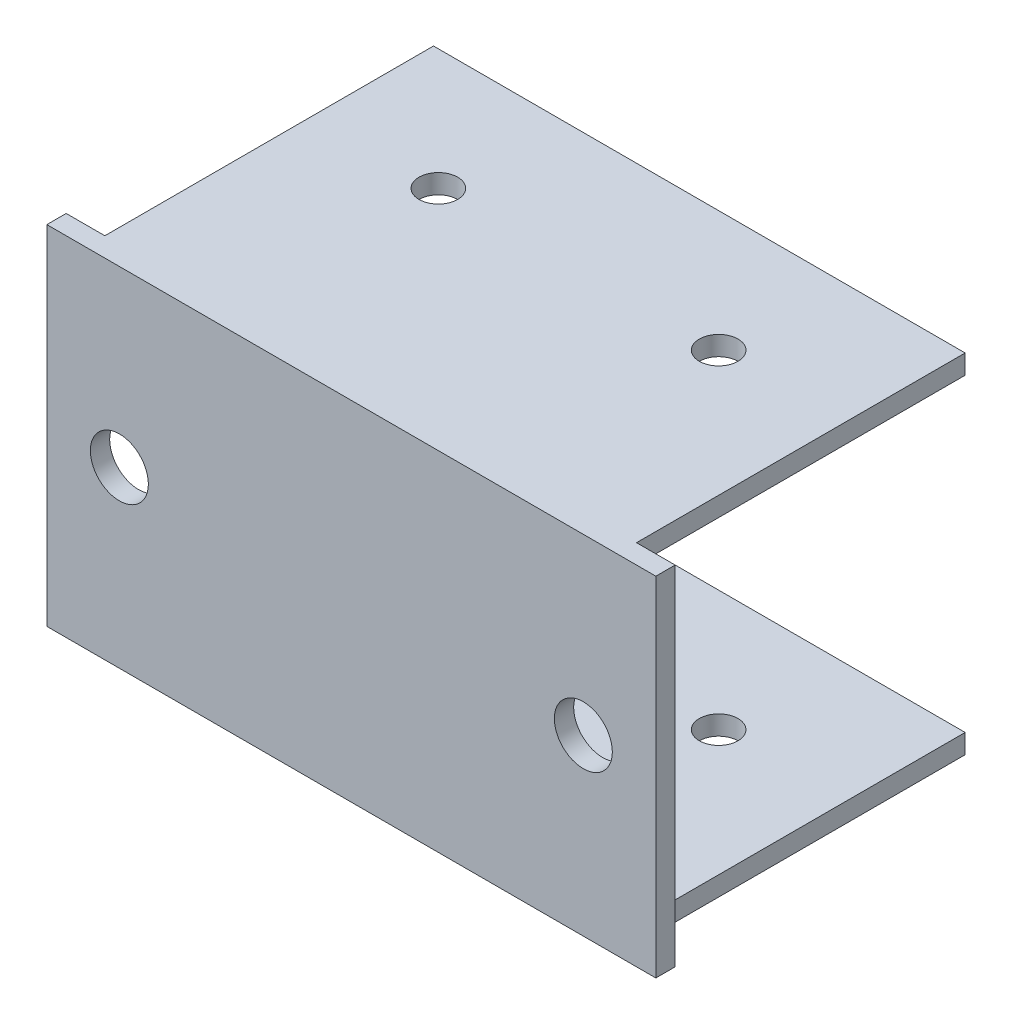
ISO-10303-21;
HEADER;
FILE_DESCRIPTION(('STEP AP214'),'2;1');
FILE_NAME('part.step','',(''),(''),'','','');
FILE_SCHEMA(('AUTOMOTIVE_DESIGN { 1 0 10303 214 1 1 1 1 }'));
ENDSEC;
DATA;
#1=APPLICATION_CONTEXT('core data for automotive mechanical design processes');
#2=APPLICATION_PROTOCOL_DEFINITION('international standard','automotive_design',2000,#1);
#3=PRODUCT_CONTEXT('',#1,'mechanical');
#4=PRODUCT('Part','Part','',(#3));
#5=PRODUCT_RELATED_PRODUCT_CATEGORY('part','',(#4));
#6=PRODUCT_DEFINITION_FORMATION('','',#4);
#7=PRODUCT_DEFINITION_CONTEXT('part definition',#1,'design');
#8=PRODUCT_DEFINITION('design','',#6,#7);
#9=PRODUCT_DEFINITION_SHAPE('','',#8);
#10=(LENGTH_UNIT() NAMED_UNIT(*) SI_UNIT(.MILLI.,.METRE.));
#11=(NAMED_UNIT(*) PLANE_ANGLE_UNIT() SI_UNIT($,.RADIAN.));
#12=(NAMED_UNIT(*) SI_UNIT($,.STERADIAN.) SOLID_ANGLE_UNIT());
#13=UNCERTAINTY_MEASURE_WITH_UNIT(LENGTH_MEASURE(1.E-05),#10,'distance_accuracy_value','');
#14=(GEOMETRIC_REPRESENTATION_CONTEXT(3) GLOBAL_UNCERTAINTY_ASSIGNED_CONTEXT((#13)) GLOBAL_UNIT_ASSIGNED_CONTEXT((#10,
#11,#12)) REPRESENTATION_CONTEXT('',''));
#15=CARTESIAN_POINT('',(0.,0.,0.));
#16=DIRECTION('',(0.,0.,1.));
#17=DIRECTION('',(1.,0.,0.));
#18=AXIS2_PLACEMENT_3D('',#15,#16,#17);
#19=CARTESIAN_POINT('',(0.,0.,0.));
#20=DIRECTION('',(0.,0.,-1.));
#21=DIRECTION('',(-1.,0.,0.));
#22=AXIS2_PLACEMENT_3D('',#19,#20,#21);
#23=PLANE('',#22);
#24=CARTESIAN_POINT('',(24.,0.,0.));
#25=DIRECTION('',(0.,0.,-1.));
#26=DIRECTION('',(-1.,0.,0.));
#27=AXIS2_PLACEMENT_3D('',#24,#25,#26);
#28=CIRCLE('',#27,2.99999999999999);
#29=CARTESIAN_POINT('',(21.,0.,0.));
#30=VERTEX_POINT('',#29);
#31=EDGE_CURVE('E191',#30,#30,#28,.T.);
#32=ORIENTED_EDGE('',*,*,#31,.F.);
#33=EDGE_LOOP('',(#32));
#34=FACE_BOUND('',#33,.T.);
#35=CARTESIAN_POINT('',(-24.,0.,0.));
#36=DIRECTION('',(0.,0.,-1.));
#37=DIRECTION('',(-1.,0.,0.));
#38=AXIS2_PLACEMENT_3D('',#35,#36,#37);
#39=CIRCLE('',#38,2.99999999999999);
#40=CARTESIAN_POINT('',(-27.,0.,0.));
#41=VERTEX_POINT('',#40);
#42=EDGE_CURVE('E195',#41,#41,#39,.T.);
#43=ORIENTED_EDGE('',*,*,#42,.F.);
#44=EDGE_LOOP('',(#43));
#45=FACE_BOUND('',#44,.T.);
#46=DIRECTION('',(1.,0.,0.));
#47=VECTOR('',#46,1.);
#48=CARTESIAN_POINT('',(-31.5,-18.,0.));
#49=LINE('',#48,#47);
#50=CARTESIAN_POINT('',(27.5,-18.,0.));
#51=VERTEX_POINT('',#50);
#52=CARTESIAN_POINT('',(31.5,-18.,0.));
#53=VERTEX_POINT('',#52);
#54=EDGE_CURVE('E213',#51,#53,#49,.T.);
#55=ORIENTED_EDGE('',*,*,#54,.F.);
#56=DIRECTION('',(0.,1.,0.));
#57=VECTOR('',#56,1.);
#58=CARTESIAN_POINT('',(27.5,0.,0.));
#59=LINE('',#58,#57);
#60=CARTESIAN_POINT('',(27.5,-16.,0.));
#61=VERTEX_POINT('',#60);
#62=EDGE_CURVE('E11',#51,#61,#59,.T.);
#63=ORIENTED_EDGE('',*,*,#62,.T.);
#64=DIRECTION('',(-1.,0.,0.));
#65=VECTOR('',#64,1.);
#66=CARTESIAN_POINT('',(0.,-16.,0.));
#67=LINE('',#66,#65);
#68=CARTESIAN_POINT('',(-27.5,-16.,0.));
#69=VERTEX_POINT('',#68);
#70=EDGE_CURVE('E238',#61,#69,#67,.T.);
#71=ORIENTED_EDGE('',*,*,#70,.T.);
#72=DIRECTION('',(0.,-1.,0.));
#73=VECTOR('',#72,1.);
#74=CARTESIAN_POINT('',(-27.5,0.,0.));
#75=LINE('',#74,#73);
#76=CARTESIAN_POINT('',(-27.5,-18.,0.));
#77=VERTEX_POINT('',#76);
#78=EDGE_CURVE('E44',#69,#77,#75,.T.);
#79=ORIENTED_EDGE('',*,*,#78,.T.);
#80=CARTESIAN_POINT('',(-31.5,-18.,0.));
#81=VERTEX_POINT('',#80);
#82=EDGE_CURVE('E214',#81,#77,#49,.T.);
#83=ORIENTED_EDGE('',*,*,#82,.F.);
#84=DIRECTION('',(0.,-1.,0.));
#85=VECTOR('',#84,1.);
#86=CARTESIAN_POINT('',(-31.5,18.,0.));
#87=LINE('',#86,#85);
#88=CARTESIAN_POINT('',(-31.5,18.,0.));
#89=VERTEX_POINT('',#88);
#90=EDGE_CURVE('E199',#89,#81,#87,.T.);
#91=ORIENTED_EDGE('',*,*,#90,.F.);
#92=DIRECTION('',(1.,0.,0.));
#93=VECTOR('',#92,1.);
#94=CARTESIAN_POINT('',(-31.5,18.,0.));
#95=LINE('',#94,#93);
#96=CARTESIAN_POINT('',(-27.5,18.,0.));
#97=VERTEX_POINT('',#96);
#98=EDGE_CURVE('E207',#89,#97,#95,.T.);
#99=ORIENTED_EDGE('',*,*,#98,.T.);
#100=DIRECTION('',(0.,1.,0.));
#101=VECTOR('',#100,1.);
#102=CARTESIAN_POINT('',(-27.5,0.,0.));
#103=LINE('',#102,#101);
#104=CARTESIAN_POINT('',(-27.5,16.,0.));
#105=VERTEX_POINT('',#104);
#106=EDGE_CURVE('E233',#105,#97,#103,.T.);
#107=ORIENTED_EDGE('',*,*,#106,.F.);
#108=DIRECTION('',(1.,0.,0.));
#109=VECTOR('',#108,1.);
#110=CARTESIAN_POINT('',(0.,16.,0.));
#111=LINE('',#110,#109);
#112=CARTESIAN_POINT('',(27.5,16.,0.));
#113=VERTEX_POINT('',#112);
#114=EDGE_CURVE('E60',#105,#113,#111,.T.);
#115=ORIENTED_EDGE('',*,*,#114,.T.);
#116=DIRECTION('',(0.,-1.,0.));
#117=VECTOR('',#116,1.);
#118=CARTESIAN_POINT('',(27.5,0.,0.));
#119=LINE('',#118,#117);
#120=CARTESIAN_POINT('',(27.5,18.,0.));
#121=VERTEX_POINT('',#120);
#122=EDGE_CURVE('E236',#121,#113,#119,.T.);
#123=ORIENTED_EDGE('',*,*,#122,.F.);
#124=CARTESIAN_POINT('',(31.5,18.,0.));
#125=VERTEX_POINT('',#124);
#126=EDGE_CURVE('E210',#121,#125,#95,.T.);
#127=ORIENTED_EDGE('',*,*,#126,.T.);
#128=DIRECTION('',(0.,-1.,0.));
#129=VECTOR('',#128,1.);
#130=CARTESIAN_POINT('',(31.5,18.,0.));
#131=LINE('',#130,#129);
#132=EDGE_CURVE('E209',#125,#53,#131,.T.);
#133=ORIENTED_EDGE('',*,*,#132,.T.);
#134=EDGE_LOOP('',(#55,#63,#71,#79,#83,#91,#99,#107,#115,#123,#127,#133));
#135=FACE_BOUND('',#134,.T.);
#136=ADVANCED_FACE('F35',(#34,#45,#135),#23,.T.);
#137=CARTESIAN_POINT('',(-31.5,18.,2.));
#138=DIRECTION('',(0.,1.,0.));
#139=DIRECTION('',(0.,0.,1.));
#140=AXIS2_PLACEMENT_3D('',#137,#138,#139);
#141=PLANE('',#140);
#142=CARTESIAN_POINT('',(14.5,18.,-21.5));
#143=DIRECTION('',(0.,1.,0.));
#144=DIRECTION('',(0.,0.,1.));
#145=AXIS2_PLACEMENT_3D('',#142,#143,#144);
#146=CIRCLE('',#145,2.);
#147=CARTESIAN_POINT('',(14.5,18.,-19.5));
#148=VERTEX_POINT('',#147);
#149=EDGE_CURVE('E158',#148,#148,#146,.T.);
#150=ORIENTED_EDGE('',*,*,#149,.F.);
#151=EDGE_LOOP('',(#150));
#152=FACE_BOUND('',#151,.T.);
#153=CARTESIAN_POINT('',(-14.5,18.,-21.5));
#154=DIRECTION('',(0.,1.,0.));
#155=DIRECTION('',(0.,0.,1.));
#156=AXIS2_PLACEMENT_3D('',#153,#154,#155);
#157=CIRCLE('',#156,2.);
#158=CARTESIAN_POINT('',(-14.5,18.,-19.5));
#159=VERTEX_POINT('',#158);
#160=EDGE_CURVE('E163',#159,#159,#157,.T.);
#161=ORIENTED_EDGE('',*,*,#160,.F.);
#162=EDGE_LOOP('',(#161));
#163=FACE_BOUND('',#162,.T.);
#164=DIRECTION('',(1.,0.,0.));
#165=VECTOR('',#164,1.);
#166=CARTESIAN_POINT('',(-31.5,18.,2.));
#167=LINE('',#166,#165);
#168=CARTESIAN_POINT('',(-31.5,18.,2.));
#169=VERTEX_POINT('',#168);
#170=CARTESIAN_POINT('',(31.5,18.,2.));
#171=VERTEX_POINT('',#170);
#172=EDGE_CURVE('E196',#169,#171,#167,.T.);
#173=ORIENTED_EDGE('',*,*,#172,.T.);
#174=DIRECTION('',(0.,0.,-1.));
#175=VECTOR('',#174,1.);
#176=CARTESIAN_POINT('',(31.5,18.,2.));
#177=LINE('',#176,#175);
#178=EDGE_CURVE('E206',#171,#125,#177,.T.);
#179=ORIENTED_EDGE('',*,*,#178,.T.);
#180=ORIENTED_EDGE('',*,*,#126,.F.);
#181=DIRECTION('',(0.,0.,-1.));
#182=VECTOR('',#181,1.);
#183=CARTESIAN_POINT('',(27.5,18.,-34.));
#184=LINE('',#183,#182);
#185=CARTESIAN_POINT('',(27.5,18.,-34.));
#186=VERTEX_POINT('',#185);
#187=EDGE_CURVE('E177',#121,#186,#184,.T.);
#188=ORIENTED_EDGE('',*,*,#187,.T.);
#189=DIRECTION('',(-1.,0.,0.));
#190=VECTOR('',#189,1.);
#191=CARTESIAN_POINT('',(-27.5,18.,-34.));
#192=LINE('',#191,#190);
#193=CARTESIAN_POINT('',(-27.5,18.,-34.));
#194=VERTEX_POINT('',#193);
#195=EDGE_CURVE('E179',#186,#194,#192,.T.);
#196=ORIENTED_EDGE('',*,*,#195,.T.);
#197=DIRECTION('',(0.,0.,1.));
#198=VECTOR('',#197,1.);
#199=CARTESIAN_POINT('',(-27.5,18.,-34.));
#200=LINE('',#199,#198);
#201=EDGE_CURVE('E170',#194,#97,#200,.T.);
#202=ORIENTED_EDGE('',*,*,#201,.T.);
#203=ORIENTED_EDGE('',*,*,#98,.F.);
#204=DIRECTION('',(0.,0.,-1.));
#205=VECTOR('',#204,1.);
#206=CARTESIAN_POINT('',(-31.5,18.,2.));
#207=LINE('',#206,#205);
#208=EDGE_CURVE('E218',#169,#89,#207,.T.);
#209=ORIENTED_EDGE('',*,*,#208,.F.);
#210=EDGE_LOOP('',(#173,#179,#180,#188,#196,#202,#203,#209));
#211=FACE_BOUND('',#210,.T.);
#212=ADVANCED_FACE('F37',(#152,#163,#211),#141,.T.);
#213=CARTESIAN_POINT('',(-31.5,18.,2.));
#214=DIRECTION('',(1.,0.,0.));
#215=DIRECTION('',(0.,1.,0.));
#216=AXIS2_PLACEMENT_3D('',#213,#214,#215);
#217=PLANE('',#216);
#218=ORIENTED_EDGE('',*,*,#90,.T.);
#219=DIRECTION('',(0.,0.,-1.));
#220=VECTOR('',#219,1.);
#221=CARTESIAN_POINT('',(-31.5,-18.,2.));
#222=LINE('',#221,#220);
#223=CARTESIAN_POINT('',(-31.5,-18.,2.));
#224=VERTEX_POINT('',#223);
#225=EDGE_CURVE('E220',#224,#81,#222,.T.);
#226=ORIENTED_EDGE('',*,*,#225,.F.);
#227=DIRECTION('',(0.,-1.,0.));
#228=VECTOR('',#227,1.);
#229=CARTESIAN_POINT('',(-31.5,18.,2.));
#230=LINE('',#229,#228);
#231=EDGE_CURVE('E204',#169,#224,#230,.T.);
#232=ORIENTED_EDGE('',*,*,#231,.F.);
#233=ORIENTED_EDGE('',*,*,#208,.T.);
#234=EDGE_LOOP('',(#218,#226,#232,#233));
#235=FACE_BOUND('',#234,.T.);
#236=ADVANCED_FACE('F283',(#235),#217,.F.);
#237=CARTESIAN_POINT('',(-31.5,-18.,2.));
#238=DIRECTION('',(0.,1.,0.));
#239=DIRECTION('',(0.,0.,1.));
#240=AXIS2_PLACEMENT_3D('',#237,#238,#239);
#241=PLANE('',#240);
#242=CARTESIAN_POINT('',(14.5,-18.,-21.5));
#243=DIRECTION('',(0.,1.,0.));
#244=DIRECTION('',(0.,0.,1.));
#245=AXIS2_PLACEMENT_3D('',#242,#243,#244);
#246=CIRCLE('',#245,2.);
#247=CARTESIAN_POINT('',(14.5,-18.,-19.5));
#248=VERTEX_POINT('',#247);
#249=EDGE_CURVE('E252',#248,#248,#246,.T.);
#250=ORIENTED_EDGE('',*,*,#249,.T.);
#251=EDGE_LOOP('',(#250));
#252=FACE_BOUND('',#251,.T.);
#253=CARTESIAN_POINT('',(-14.5,-18.,-21.5));
#254=DIRECTION('',(0.,1.,0.));
#255=DIRECTION('',(0.,0.,1.));
#256=AXIS2_PLACEMENT_3D('',#253,#254,#255);
#257=CIRCLE('',#256,2.);
#258=CARTESIAN_POINT('',(-14.5,-18.,-19.5));
#259=VERTEX_POINT('',#258);
#260=EDGE_CURVE('E245',#259,#259,#257,.T.);
#261=ORIENTED_EDGE('',*,*,#260,.T.);
#262=EDGE_LOOP('',(#261));
#263=FACE_BOUND('',#262,.T.);
#264=DIRECTION('',(0.,0.,-1.));
#265=VECTOR('',#264,1.);
#266=CARTESIAN_POINT('',(31.5,-18.,2.));
#267=LINE('',#266,#265);
#268=CARTESIAN_POINT('',(31.5,-18.,2.));
#269=VERTEX_POINT('',#268);
#270=EDGE_CURVE('E223',#269,#53,#267,.T.);
#271=ORIENTED_EDGE('',*,*,#270,.F.);
#272=DIRECTION('',(1.,0.,0.));
#273=VECTOR('',#272,1.);
#274=CARTESIAN_POINT('',(-31.5,-18.,2.));
#275=LINE('',#274,#273);
#276=EDGE_CURVE('E202',#224,#269,#275,.T.);
#277=ORIENTED_EDGE('',*,*,#276,.F.);
#278=ORIENTED_EDGE('',*,*,#225,.T.);
#279=ORIENTED_EDGE('',*,*,#82,.T.);
#280=DIRECTION('',(0.,0.,1.));
#281=VECTOR('',#280,1.);
#282=CARTESIAN_POINT('',(-27.5,-18.,-34.));
#283=LINE('',#282,#281);
#284=CARTESIAN_POINT('',(-27.5,-18.,-34.));
#285=VERTEX_POINT('',#284);
#286=EDGE_CURVE('E154',#285,#77,#283,.T.);
#287=ORIENTED_EDGE('',*,*,#286,.F.);
#288=DIRECTION('',(-1.,0.,0.));
#289=VECTOR('',#288,1.);
#290=CARTESIAN_POINT('',(-27.5,-18.,-34.));
#291=LINE('',#290,#289);
#292=CARTESIAN_POINT('',(27.5,-18.,-34.));
#293=VERTEX_POINT('',#292);
#294=EDGE_CURVE('E142',#293,#285,#291,.T.);
#295=ORIENTED_EDGE('',*,*,#294,.F.);
#296=DIRECTION('',(0.,0.,-1.));
#297=VECTOR('',#296,1.);
#298=CARTESIAN_POINT('',(27.5,-18.,-34.));
#299=LINE('',#298,#297);
#300=EDGE_CURVE('E52',#51,#293,#299,.T.);
#301=ORIENTED_EDGE('',*,*,#300,.F.);
#302=ORIENTED_EDGE('',*,*,#54,.T.);
#303=EDGE_LOOP('',(#271,#277,#278,#279,#287,#295,#301,#302));
#304=FACE_BOUND('',#303,.T.);
#305=ADVANCED_FACE('F257',(#252,#263,#304),#241,.F.);
#306=CARTESIAN_POINT('',(31.5,18.,2.));
#307=DIRECTION('',(1.,0.,0.));
#308=DIRECTION('',(0.,0.,-1.));
#309=AXIS2_PLACEMENT_3D('',#306,#307,#308);
#310=PLANE('',#309);
#311=ORIENTED_EDGE('',*,*,#132,.F.);
#312=ORIENTED_EDGE('',*,*,#178,.F.);
#313=DIRECTION('',(0.,-1.,0.));
#314=VECTOR('',#313,1.);
#315=CARTESIAN_POINT('',(31.5,18.,2.));
#316=LINE('',#315,#314);
#317=EDGE_CURVE('E198',#171,#269,#316,.T.);
#318=ORIENTED_EDGE('',*,*,#317,.T.);
#319=ORIENTED_EDGE('',*,*,#270,.T.);
#320=EDGE_LOOP('',(#311,#312,#318,#319));
#321=FACE_BOUND('',#320,.T.);
#322=ADVANCED_FACE('F295',(#321),#310,.T.);
#323=CARTESIAN_POINT('',(0.,0.,2.));
#324=DIRECTION('',(0.,0.,-1.));
#325=DIRECTION('',(-1.,0.,0.));
#326=AXIS2_PLACEMENT_3D('',#323,#324,#325);
#327=PLANE('',#326);
#328=ORIENTED_EDGE('',*,*,#276,.T.);
#329=ORIENTED_EDGE('',*,*,#317,.F.);
#330=ORIENTED_EDGE('',*,*,#172,.F.);
#331=ORIENTED_EDGE('',*,*,#231,.T.);
#332=EDGE_LOOP('',(#328,#329,#330,#331));
#333=FACE_BOUND('',#332,.T.);
#334=CARTESIAN_POINT('',(-24.,0.,2.));
#335=DIRECTION('',(0.,0.,1.));
#336=DIRECTION('',(1.,0.,0.));
#337=AXIS2_PLACEMENT_3D('',#334,#335,#336);
#338=CIRCLE('',#337,2.99999999999999);
#339=CARTESIAN_POINT('',(-21.,0.,2.));
#340=VERTEX_POINT('',#339);
#341=EDGE_CURVE('E192',#340,#340,#338,.T.);
#342=ORIENTED_EDGE('',*,*,#341,.F.);
#343=EDGE_LOOP('',(#342));
#344=FACE_BOUND('',#343,.T.);
#345=CARTESIAN_POINT('',(24.,0.,2.));
#346=DIRECTION('',(0.,0.,1.));
#347=DIRECTION('',(1.,0.,0.));
#348=AXIS2_PLACEMENT_3D('',#345,#346,#347);
#349=CIRCLE('',#348,2.99999999999999);
#350=CARTESIAN_POINT('',(27.,0.,2.));
#351=VERTEX_POINT('',#350);
#352=EDGE_CURVE('E186',#351,#351,#349,.T.);
#353=ORIENTED_EDGE('',*,*,#352,.F.);
#354=EDGE_LOOP('',(#353));
#355=FACE_BOUND('',#354,.T.);
#356=ADVANCED_FACE('F289',(#333,#344,#355),#327,.F.);
#357=CARTESIAN_POINT('',(-24.,0.,-8.));
#358=DIRECTION('',(0.,0.,1.));
#359=DIRECTION('',(1.,0.,0.));
#360=AXIS2_PLACEMENT_3D('',#357,#358,#359);
#361=CYLINDRICAL_SURFACE('',#360,2.99999999999999);
#362=ORIENTED_EDGE('',*,*,#42,.T.);
#363=EDGE_LOOP('',(#362));
#364=FACE_BOUND('',#363,.T.);
#365=ORIENTED_EDGE('',*,*,#341,.T.);
#366=EDGE_LOOP('',(#365));
#367=FACE_BOUND('',#366,.T.);
#368=ADVANCED_FACE('F301',(#364,#367),#361,.F.);
#369=CARTESIAN_POINT('',(24.,0.,-8.));
#370=DIRECTION('',(0.,0.,1.));
#371=DIRECTION('',(1.,0.,0.));
#372=AXIS2_PLACEMENT_3D('',#369,#370,#371);
#373=CYLINDRICAL_SURFACE('',#372,2.99999999999999);
#374=ORIENTED_EDGE('',*,*,#31,.T.);
#375=EDGE_LOOP('',(#374));
#376=FACE_BOUND('',#375,.T.);
#377=ORIENTED_EDGE('',*,*,#352,.T.);
#378=EDGE_LOOP('',(#377));
#379=FACE_BOUND('',#378,.T.);
#380=ADVANCED_FACE('F349',(#376,#379),#373,.F.);
#381=CARTESIAN_POINT('',(27.5,16.,-34.));
#382=DIRECTION('',(1.,0.,0.));
#383=DIRECTION('',(0.,0.,-1.));
#384=AXIS2_PLACEMENT_3D('',#381,#382,#383);
#385=PLANE('',#384);
#386=ORIENTED_EDGE('',*,*,#187,.F.);
#387=ORIENTED_EDGE('',*,*,#122,.T.);
#388=DIRECTION('',(0.,0.,-1.));
#389=VECTOR('',#388,1.);
#390=CARTESIAN_POINT('',(27.5,16.,-34.));
#391=LINE('',#390,#389);
#392=CARTESIAN_POINT('',(27.5,16.,-34.));
#393=VERTEX_POINT('',#392);
#394=EDGE_CURVE('E167',#113,#393,#391,.T.);
#395=ORIENTED_EDGE('',*,*,#394,.T.);
#396=DIRECTION('',(0.,1.,0.));
#397=VECTOR('',#396,1.);
#398=CARTESIAN_POINT('',(27.5,16.,-34.));
#399=LINE('',#398,#397);
#400=EDGE_CURVE('E176',#393,#186,#399,.T.);
#401=ORIENTED_EDGE('',*,*,#400,.T.);
#402=EDGE_LOOP('',(#386,#387,#395,#401));
#403=FACE_BOUND('',#402,.T.);
#404=ADVANCED_FACE('F342',(#403),#385,.T.);
#405=CARTESIAN_POINT('',(-27.5,16.,-34.));
#406=DIRECTION('',(-1.,0.,0.));
#407=DIRECTION('',(0.,0.,1.));
#408=AXIS2_PLACEMENT_3D('',#405,#406,#407);
#409=PLANE('',#408);
#410=DIRECTION('',(0.,0.,1.));
#411=VECTOR('',#410,1.);
#412=CARTESIAN_POINT('',(-27.5,16.,-34.));
#413=LINE('',#412,#411);
#414=CARTESIAN_POINT('',(-27.5,16.,-34.));
#415=VERTEX_POINT('',#414);
#416=EDGE_CURVE('E173',#415,#105,#413,.T.);
#417=ORIENTED_EDGE('',*,*,#416,.T.);
#418=ORIENTED_EDGE('',*,*,#106,.T.);
#419=ORIENTED_EDGE('',*,*,#201,.F.);
#420=DIRECTION('',(0.,1.,0.));
#421=VECTOR('',#420,1.);
#422=CARTESIAN_POINT('',(-27.5,16.,-34.));
#423=LINE('',#422,#421);
#424=EDGE_CURVE('E184',#415,#194,#423,.T.);
#425=ORIENTED_EDGE('',*,*,#424,.F.);
#426=EDGE_LOOP('',(#417,#418,#419,#425));
#427=FACE_BOUND('',#426,.T.);
#428=ADVANCED_FACE('F339',(#427),#409,.T.);
#429=CARTESIAN_POINT('',(-27.5,16.,-34.));
#430=DIRECTION('',(0.,0.,-1.));
#431=DIRECTION('',(-1.,0.,0.));
#432=AXIS2_PLACEMENT_3D('',#429,#430,#431);
#433=PLANE('',#432);
#434=ORIENTED_EDGE('',*,*,#195,.F.);
#435=ORIENTED_EDGE('',*,*,#400,.F.);
#436=DIRECTION('',(-1.,0.,0.));
#437=VECTOR('',#436,1.);
#438=CARTESIAN_POINT('',(-27.5,16.,-34.));
#439=LINE('',#438,#437);
#440=EDGE_CURVE('E169',#393,#415,#439,.T.);
#441=ORIENTED_EDGE('',*,*,#440,.T.);
#442=ORIENTED_EDGE('',*,*,#424,.T.);
#443=EDGE_LOOP('',(#434,#435,#441,#442));
#444=FACE_BOUND('',#443,.T.);
#445=ADVANCED_FACE('F337',(#444),#433,.T.);
#446=CARTESIAN_POINT('',(0.,16.,0.));
#447=DIRECTION('',(0.,1.,0.));
#448=DIRECTION('',(0.,0.,1.));
#449=AXIS2_PLACEMENT_3D('',#446,#447,#448);
#450=PLANE('',#449);
#451=CARTESIAN_POINT('',(14.5,16.,-21.5));
#452=DIRECTION('',(0.,1.,0.));
#453=DIRECTION('',(0.,0.,1.));
#454=AXIS2_PLACEMENT_3D('',#451,#452,#453);
#455=CIRCLE('',#454,2.);
#456=CARTESIAN_POINT('',(14.5,16.,-19.5));
#457=VERTEX_POINT('',#456);
#458=EDGE_CURVE('E162',#457,#457,#455,.T.);
#459=ORIENTED_EDGE('',*,*,#458,.T.);
#460=EDGE_LOOP('',(#459));
#461=FACE_BOUND('',#460,.T.);
#462=CARTESIAN_POINT('',(-14.5,16.,-21.5));
#463=DIRECTION('',(0.,1.,0.));
#464=DIRECTION('',(0.,0.,1.));
#465=AXIS2_PLACEMENT_3D('',#462,#463,#464);
#466=CIRCLE('',#465,2.);
#467=CARTESIAN_POINT('',(-14.5,16.,-19.5));
#468=VERTEX_POINT('',#467);
#469=EDGE_CURVE('E166',#468,#468,#466,.T.);
#470=ORIENTED_EDGE('',*,*,#469,.T.);
#471=EDGE_LOOP('',(#470));
#472=FACE_BOUND('',#471,.T.);
#473=ORIENTED_EDGE('',*,*,#114,.F.);
#474=ORIENTED_EDGE('',*,*,#416,.F.);
#475=ORIENTED_EDGE('',*,*,#440,.F.);
#476=ORIENTED_EDGE('',*,*,#394,.F.);
#477=EDGE_LOOP('',(#473,#474,#475,#476));
#478=FACE_BOUND('',#477,.T.);
#479=ADVANCED_FACE('F333',(#461,#472,#478),#450,.F.);
#480=CARTESIAN_POINT('',(-14.5,-18.,-21.5));
#481=DIRECTION('',(0.,1.,0.));
#482=DIRECTION('',(0.,0.,1.));
#483=AXIS2_PLACEMENT_3D('',#480,#481,#482);
#484=CYLINDRICAL_SURFACE('',#483,2.);
#485=ORIENTED_EDGE('',*,*,#160,.T.);
#486=EDGE_LOOP('',(#485));
#487=FACE_BOUND('',#486,.T.);
#488=ORIENTED_EDGE('',*,*,#469,.F.);
#489=EDGE_LOOP('',(#488));
#490=FACE_BOUND('',#489,.T.);
#491=ADVANCED_FACE('F327',(#487,#490),#484,.F.);
#492=CARTESIAN_POINT('',(14.5,-18.,-21.5));
#493=DIRECTION('',(0.,1.,0.));
#494=DIRECTION('',(0.,0.,1.));
#495=AXIS2_PLACEMENT_3D('',#492,#493,#494);
#496=CYLINDRICAL_SURFACE('',#495,2.);
#497=ORIENTED_EDGE('',*,*,#149,.T.);
#498=EDGE_LOOP('',(#497));
#499=FACE_BOUND('',#498,.T.);
#500=ORIENTED_EDGE('',*,*,#458,.F.);
#501=EDGE_LOOP('',(#500));
#502=FACE_BOUND('',#501,.T.);
#503=ADVANCED_FACE('F321',(#499,#502),#496,.F.);
#504=CARTESIAN_POINT('',(27.5,-16.,-34.));
#505=DIRECTION('',(-1.,0.,0.));
#506=DIRECTION('',(0.,0.,1.));
#507=AXIS2_PLACEMENT_3D('',#504,#505,#506);
#508=PLANE('',#507);
#509=ORIENTED_EDGE('',*,*,#62,.F.);
#510=ORIENTED_EDGE('',*,*,#300,.T.);
#511=DIRECTION('',(0.,-1.,0.));
#512=VECTOR('',#511,1.);
#513=CARTESIAN_POINT('',(27.5,-16.,-34.));
#514=LINE('',#513,#512);
#515=CARTESIAN_POINT('',(27.5,-16.,-34.));
#516=VERTEX_POINT('',#515);
#517=EDGE_CURVE('E145',#516,#293,#514,.T.);
#518=ORIENTED_EDGE('',*,*,#517,.F.);
#519=DIRECTION('',(0.,0.,-1.));
#520=VECTOR('',#519,1.);
#521=CARTESIAN_POINT('',(27.5,-16.,-34.));
#522=LINE('',#521,#520);
#523=EDGE_CURVE('E134',#61,#516,#522,.T.);
#524=ORIENTED_EDGE('',*,*,#523,.F.);
#525=EDGE_LOOP('',(#509,#510,#518,#524));
#526=FACE_BOUND('',#525,.T.);
#527=ADVANCED_FACE('F319',(#526),#508,.F.);
#528=CARTESIAN_POINT('',(-27.5,-16.,-34.));
#529=DIRECTION('',(0.,0.,1.));
#530=DIRECTION('',(1.,0.,0.));
#531=AXIS2_PLACEMENT_3D('',#528,#529,#530);
#532=PLANE('',#531);
#533=ORIENTED_EDGE('',*,*,#294,.T.);
#534=DIRECTION('',(0.,-1.,0.));
#535=VECTOR('',#534,1.);
#536=CARTESIAN_POINT('',(-27.5,-16.,-34.));
#537=LINE('',#536,#535);
#538=CARTESIAN_POINT('',(-27.5,-16.,-34.));
#539=VERTEX_POINT('',#538);
#540=EDGE_CURVE('E138',#539,#285,#537,.T.);
#541=ORIENTED_EDGE('',*,*,#540,.F.);
#542=DIRECTION('',(-1.,0.,0.));
#543=VECTOR('',#542,1.);
#544=CARTESIAN_POINT('',(-27.5,-16.,-34.));
#545=LINE('',#544,#543);
#546=EDGE_CURVE('E127',#516,#539,#545,.T.);
#547=ORIENTED_EDGE('',*,*,#546,.F.);
#548=ORIENTED_EDGE('',*,*,#517,.T.);
#549=EDGE_LOOP('',(#533,#541,#547,#548));
#550=FACE_BOUND('',#549,.T.);
#551=ADVANCED_FACE('F141',(#550),#532,.F.);
#552=CARTESIAN_POINT('',(-27.5,-16.,-34.));
#553=DIRECTION('',(1.,0.,0.));
#554=DIRECTION('',(0.,0.,-1.));
#555=AXIS2_PLACEMENT_3D('',#552,#553,#554);
#556=PLANE('',#555);
#557=ORIENTED_EDGE('',*,*,#78,.F.);
#558=DIRECTION('',(0.,0.,1.));
#559=VECTOR('',#558,1.);
#560=CARTESIAN_POINT('',(-27.5,-16.,-34.));
#561=LINE('',#560,#559);
#562=EDGE_CURVE('E131',#539,#69,#561,.T.);
#563=ORIENTED_EDGE('',*,*,#562,.F.);
#564=ORIENTED_EDGE('',*,*,#540,.T.);
#565=ORIENTED_EDGE('',*,*,#286,.T.);
#566=EDGE_LOOP('',(#557,#563,#564,#565));
#567=FACE_BOUND('',#566,.T.);
#568=ADVANCED_FACE('F147',(#567),#556,.F.);
#569=CARTESIAN_POINT('',(0.,-16.,0.));
#570=DIRECTION('',(0.,-1.,0.));
#571=DIRECTION('',(0.,0.,1.));
#572=AXIS2_PLACEMENT_3D('',#569,#570,#571);
#573=PLANE('',#572);
#574=CARTESIAN_POINT('',(14.5,-16.,-21.5));
#575=DIRECTION('',(0.,-1.,0.));
#576=DIRECTION('',(0.,0.,-1.));
#577=AXIS2_PLACEMENT_3D('',#574,#575,#576);
#578=CIRCLE('',#577,2.);
#579=CARTESIAN_POINT('',(14.5,-16.,-23.5));
#580=VERTEX_POINT('',#579);
#581=EDGE_CURVE('E39',#580,#580,#578,.F.);
#582=ORIENTED_EDGE('',*,*,#581,.F.);
#583=EDGE_LOOP('',(#582));
#584=FACE_BOUND('',#583,.T.);
#585=CARTESIAN_POINT('',(-14.5,-16.,-21.5));
#586=DIRECTION('',(0.,-1.,0.));
#587=DIRECTION('',(0.,0.,-1.));
#588=AXIS2_PLACEMENT_3D('',#585,#586,#587);
#589=CIRCLE('',#588,2.);
#590=CARTESIAN_POINT('',(-14.5,-16.,-23.5));
#591=VERTEX_POINT('',#590);
#592=EDGE_CURVE('E155',#591,#591,#589,.F.);
#593=ORIENTED_EDGE('',*,*,#592,.F.);
#594=EDGE_LOOP('',(#593));
#595=FACE_BOUND('',#594,.T.);
#596=ORIENTED_EDGE('',*,*,#70,.F.);
#597=ORIENTED_EDGE('',*,*,#523,.T.);
#598=ORIENTED_EDGE('',*,*,#546,.T.);
#599=ORIENTED_EDGE('',*,*,#562,.T.);
#600=EDGE_LOOP('',(#596,#597,#598,#599));
#601=FACE_BOUND('',#600,.T.);
#602=ADVANCED_FACE('F129',(#584,#595,#601),#573,.F.);
#603=CARTESIAN_POINT('',(-14.5,18.,-21.5));
#604=DIRECTION('',(0.,-1.,0.));
#605=DIRECTION('',(0.,0.,-1.));
#606=AXIS2_PLACEMENT_3D('',#603,#604,#605);
#607=CYLINDRICAL_SURFACE('',#606,2.);
#608=ORIENTED_EDGE('',*,*,#260,.F.);
#609=EDGE_LOOP('',(#608));
#610=FACE_BOUND('',#609,.T.);
#611=ORIENTED_EDGE('',*,*,#592,.T.);
#612=EDGE_LOOP('',(#611));
#613=FACE_BOUND('',#612,.T.);
#614=ADVANCED_FACE('F262',(#610,#613),#607,.F.);
#615=CARTESIAN_POINT('',(14.5,18.,-21.5));
#616=DIRECTION('',(0.,-1.,0.));
#617=DIRECTION('',(0.,0.,-1.));
#618=AXIS2_PLACEMENT_3D('',#615,#616,#617);
#619=CYLINDRICAL_SURFACE('',#618,2.);
#620=ORIENTED_EDGE('',*,*,#249,.F.);
#621=EDGE_LOOP('',(#620));
#622=FACE_BOUND('',#621,.T.);
#623=ORIENTED_EDGE('',*,*,#581,.T.);
#624=EDGE_LOOP('',(#623));
#625=FACE_BOUND('',#624,.T.);
#626=ADVANCED_FACE('F259',(#622,#625),#619,.F.);
#627=CLOSED_SHELL('',(#136,#212,#236,#305,#322,#356,#368,#380,#404,#428,#445,#479,#491,#503,
#527,#551,#568,#602,#614,#626));
#628=MANIFOLD_SOLID_BREP('B2',#627);
#629=ADVANCED_BREP_SHAPE_REPRESENTATION('',(#18,#628),#14);
#630=SHAPE_DEFINITION_REPRESENTATION(#9,#629);
ENDSEC;
END-ISO-10303-21;
